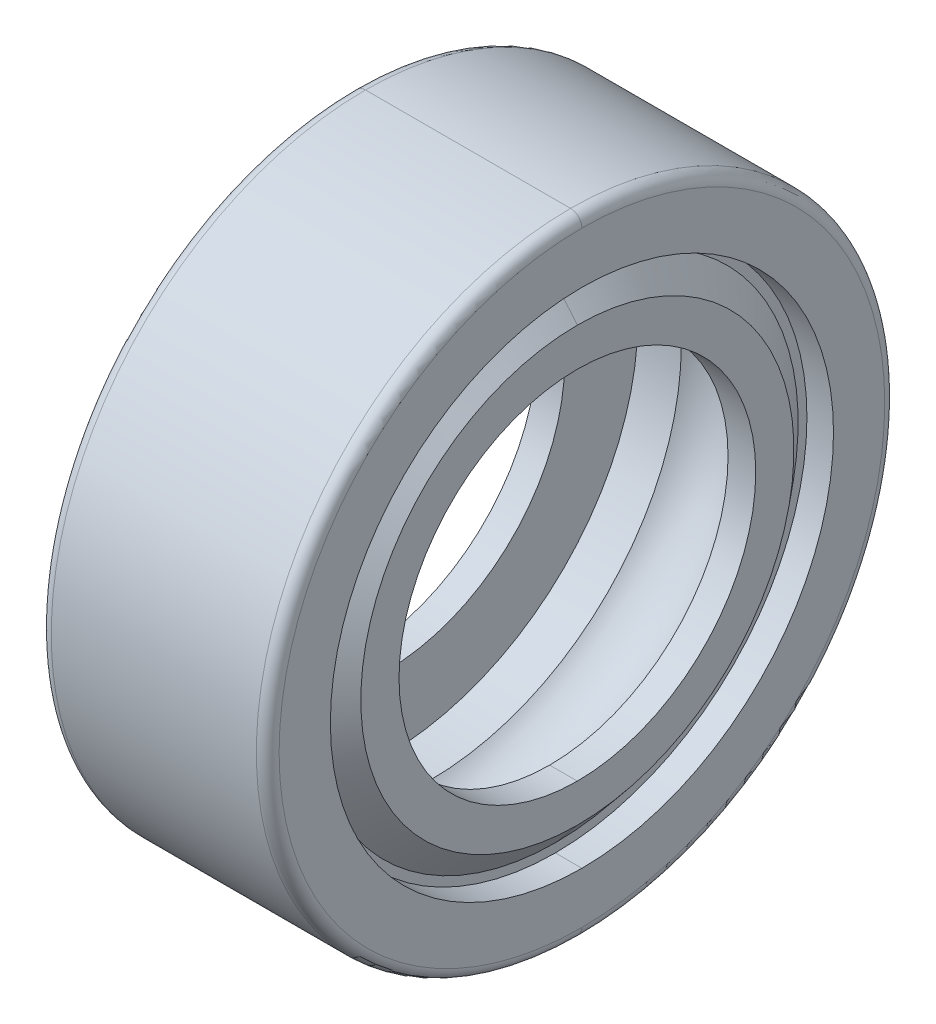
ISO-10303-21;
HEADER;
FILE_DESCRIPTION(('STEP AP214'),'2;1');
FILE_NAME('part.step','',(''),(''),'','','');
FILE_SCHEMA(('AUTOMOTIVE_DESIGN { 1 0 10303 214 1 1 1 1 }'));
ENDSEC;
DATA;
#1=APPLICATION_CONTEXT('core data for automotive mechanical design processes');
#2=APPLICATION_PROTOCOL_DEFINITION('international standard','automotive_design',2000,#1);
#3=PRODUCT_CONTEXT('',#1,'mechanical');
#4=PRODUCT('Part','Part','',(#3));
#5=PRODUCT_RELATED_PRODUCT_CATEGORY('part','',(#4));
#6=PRODUCT_DEFINITION_FORMATION('','',#4);
#7=PRODUCT_DEFINITION_CONTEXT('part definition',#1,'design');
#8=PRODUCT_DEFINITION('design','',#6,#7);
#9=PRODUCT_DEFINITION_SHAPE('','',#8);
#10=(LENGTH_UNIT() NAMED_UNIT(*) SI_UNIT(.MILLI.,.METRE.));
#11=(NAMED_UNIT(*) PLANE_ANGLE_UNIT() SI_UNIT($,.RADIAN.));
#12=(NAMED_UNIT(*) SI_UNIT($,.STERADIAN.) SOLID_ANGLE_UNIT());
#13=UNCERTAINTY_MEASURE_WITH_UNIT(LENGTH_MEASURE(1.E-05),#10,'distance_accuracy_value','');
#14=(GEOMETRIC_REPRESENTATION_CONTEXT(3) GLOBAL_UNCERTAINTY_ASSIGNED_CONTEXT((#13)) GLOBAL_UNIT_ASSIGNED_CONTEXT((#10,
#11,#12)) REPRESENTATION_CONTEXT('',''));
#15=CARTESIAN_POINT('',(0.,0.,0.));
#16=DIRECTION('',(0.,0.,1.));
#17=DIRECTION('',(1.,0.,0.));
#18=AXIS2_PLACEMENT_3D('',#15,#16,#17);
#19=CARTESIAN_POINT('',(-1.52914173633304,0.,0.));
#20=DIRECTION('',(1.,0.,0.));
#21=DIRECTION('',(0.,1.,0.));
#22=AXIS2_PLACEMENT_3D('',#19,#20,#21);
#23=PLANE('',#22);
#24=CARTESIAN_POINT('',(-1.52914173633304,0.,0.));
#25=DIRECTION('',(-1.,0.,0.));
#26=DIRECTION('',(0.,1.,0.));
#27=AXIS2_PLACEMENT_3D('',#24,#25,#26);
#28=CIRCLE('',#27,4.2484058415);
#29=CARTESIAN_POINT('',(-1.52914173633304,4.2484058415,0.));
#30=VERTEX_POINT('',#29);
#31=CARTESIAN_POINT('',(-1.52914173633304,-4.2484058415,0.));
#32=VERTEX_POINT('',#31);
#33=EDGE_CURVE('E270',#30,#32,#28,.T.);
#34=ORIENTED_EDGE('',*,*,#33,.F.);
#35=CARTESIAN_POINT('',(-1.52914173633304,0.,0.));
#36=DIRECTION('',(1.,0.,0.));
#37=DIRECTION('',(0.,1.,0.));
#38=AXIS2_PLACEMENT_3D('',#35,#36,#37);
#39=CIRCLE('',#38,4.2484058415);
#40=EDGE_CURVE('E303',#30,#32,#39,.T.);
#41=ORIENTED_EDGE('',*,*,#40,.T.);
#42=EDGE_LOOP('',(#34,#41));
#43=FACE_BOUND('',#42,.T.);
#44=CARTESIAN_POINT('',(-1.52914173633304,0.,0.));
#45=DIRECTION('',(1.,0.,0.));
#46=DIRECTION('',(0.,-1.,0.));
#47=AXIS2_PLACEMENT_3D('',#44,#45,#46);
#48=CIRCLE('',#47,4.4024931);
#49=CARTESIAN_POINT('',(-1.52914173633304,-4.4024931,0.));
#50=VERTEX_POINT('',#49);
#51=CARTESIAN_POINT('',(-1.52914173633304,4.4024931,0.));
#52=VERTEX_POINT('',#51);
#53=EDGE_CURVE('E28',#50,#52,#48,.T.);
#54=ORIENTED_EDGE('',*,*,#53,.F.);
#55=CARTESIAN_POINT('',(-1.52914173633304,0.,0.));
#56=DIRECTION('',(1.,0.,0.));
#57=DIRECTION('',(0.,1.,0.));
#58=AXIS2_PLACEMENT_3D('',#55,#56,#57);
#59=CIRCLE('',#58,4.4024931);
#60=EDGE_CURVE('E11',#52,#50,#59,.T.);
#61=ORIENTED_EDGE('',*,*,#60,.F.);
#62=EDGE_LOOP('',(#54,#61));
#63=FACE_BOUND('',#62,.T.);
#64=ADVANCED_FACE('F17',(#43,#63),#23,.F.);
#65=CARTESIAN_POINT('',(-2.19329,0.,0.));
#66=DIRECTION('',(1.,0.,0.));
#67=DIRECTION('',(0.,-1.,0.));
#68=AXIS2_PLACEMENT_3D('',#65,#66,#67);
#69=CYLINDRICAL_SURFACE('',#68,4.4024931);
#70=DIRECTION('',(1.,0.,0.));
#71=VECTOR('',#70,1.);
#72=CARTESIAN_POINT('',(-1.9939,-4.4024931,0.));
#73=LINE('',#72,#71);
#74=CARTESIAN_POINT('',(-1.9939,-4.4024931,0.));
#75=VERTEX_POINT('',#74);
#76=EDGE_CURVE('E355',#75,#50,#73,.T.);
#77=ORIENTED_EDGE('',*,*,#76,.F.);
#78=CARTESIAN_POINT('',(-1.9939,0.,0.));
#79=DIRECTION('',(1.,0.,0.));
#80=DIRECTION('',(0.,1.,0.));
#81=AXIS2_PLACEMENT_3D('',#78,#79,#80);
#82=CIRCLE('',#81,4.4024931);
#83=CARTESIAN_POINT('',(-1.9939,4.4024931,0.));
#84=VERTEX_POINT('',#83);
#85=EDGE_CURVE('E191',#84,#75,#82,.T.);
#86=ORIENTED_EDGE('',*,*,#85,.F.);
#87=DIRECTION('',(1.,0.,0.));
#88=VECTOR('',#87,1.);
#89=CARTESIAN_POINT('',(-1.9939,4.4024931,0.));
#90=LINE('',#89,#88);
#91=EDGE_CURVE('E194',#84,#52,#90,.T.);
#92=ORIENTED_EDGE('',*,*,#91,.T.);
#93=ORIENTED_EDGE('',*,*,#60,.T.);
#94=EDGE_LOOP('',(#77,#86,#92,#93));
#95=FACE_BOUND('',#94,.T.);
#96=ADVANCED_FACE('F635',(#95),#69,.F.);
#97=CARTESIAN_POINT('',(-2.19329,0.,0.));
#98=DIRECTION('',(1.,0.,0.));
#99=DIRECTION('',(0.,-1.,0.));
#100=AXIS2_PLACEMENT_3D('',#97,#98,#99);
#101=CYLINDRICAL_SURFACE('',#100,4.4024931);
#102=ORIENTED_EDGE('',*,*,#91,.F.);
#103=CARTESIAN_POINT('',(-1.9939,0.,0.));
#104=DIRECTION('',(-1.,0.,0.));
#105=DIRECTION('',(0.,1.,0.));
#106=AXIS2_PLACEMENT_3D('',#103,#104,#105);
#107=CIRCLE('',#106,4.4024931);
#108=EDGE_CURVE('E163',#84,#75,#107,.T.);
#109=ORIENTED_EDGE('',*,*,#108,.T.);
#110=ORIENTED_EDGE('',*,*,#76,.T.);
#111=ORIENTED_EDGE('',*,*,#53,.T.);
#112=EDGE_LOOP('',(#102,#109,#110,#111));
#113=FACE_BOUND('',#112,.T.);
#114=ADVANCED_FACE('F782',(#113),#101,.F.);
#115=CARTESIAN_POINT('',(-1.9939,0.,0.));
#116=DIRECTION('',(1.,0.,0.));
#117=DIRECTION('',(0.,1.,0.));
#118=AXIS2_PLACEMENT_3D('',#115,#116,#117);
#119=PLANE('',#118);
#120=ORIENTED_EDGE('',*,*,#108,.F.);
#121=ORIENTED_EDGE('',*,*,#85,.T.);
#122=EDGE_LOOP('',(#120,#121));
#123=FACE_BOUND('',#122,.T.);
#124=CARTESIAN_POINT('',(-1.9939,0.,0.));
#125=DIRECTION('',(1.,0.,0.));
#126=DIRECTION('',(0.,1.,0.));
#127=AXIS2_PLACEMENT_3D('',#124,#125,#126);
#128=CIRCLE('',#127,5.29971);
#129=CARTESIAN_POINT('',(-1.9939,5.29971,0.));
#130=VERTEX_POINT('',#129);
#131=CARTESIAN_POINT('',(-1.9939,-5.29971,0.));
#132=VERTEX_POINT('',#131);
#133=EDGE_CURVE('E161',#130,#132,#128,.T.);
#134=ORIENTED_EDGE('',*,*,#133,.F.);
#135=CARTESIAN_POINT('',(-1.9939,0.,0.));
#136=DIRECTION('',(-1.,0.,0.));
#137=DIRECTION('',(0.,1.,0.));
#138=AXIS2_PLACEMENT_3D('',#135,#136,#137);
#139=CIRCLE('',#138,5.29971);
#140=EDGE_CURVE('E152',#130,#132,#139,.T.);
#141=ORIENTED_EDGE('',*,*,#140,.T.);
#142=EDGE_LOOP('',(#134,#141));
#143=FACE_BOUND('',#142,.T.);
#144=ADVANCED_FACE('F159',(#123,#143),#119,.F.);
#145=CARTESIAN_POINT('',(-1.79451,0.,0.));
#146=DIRECTION('',(1.,0.,0.));
#147=DIRECTION('',(0.,-1.,0.));
#148=AXIS2_PLACEMENT_3D('',#145,#146,#147);
#149=TOROIDAL_SURFACE('',#148,5.29971,0.19939);
#150=CARTESIAN_POINT('',(-1.79451,0.,0.));
#151=DIRECTION('',(-1.,0.,0.));
#152=DIRECTION('',(0.,1.,0.));
#153=AXIS2_PLACEMENT_3D('',#150,#151,#152);
#154=CIRCLE('',#153,5.4991);
#155=CARTESIAN_POINT('',(-1.79451,5.4991,0.));
#156=VERTEX_POINT('',#155);
#157=CARTESIAN_POINT('',(-1.79451,-5.4991,0.));
#158=VERTEX_POINT('',#157);
#159=EDGE_CURVE('E170',#156,#158,#154,.T.);
#160=ORIENTED_EDGE('',*,*,#159,.T.);
#161=CARTESIAN_POINT('',(-1.79451,-5.29971,0.));
#162=DIRECTION('',(0.,0.,-1.));
#163=DIRECTION('',(0.,-1.,0.));
#164=AXIS2_PLACEMENT_3D('',#161,#162,#163);
#165=CIRCLE('',#164,0.19939);
#166=EDGE_CURVE('E167',#158,#132,#165,.T.);
#167=ORIENTED_EDGE('',*,*,#166,.T.);
#168=ORIENTED_EDGE('',*,*,#140,.F.);
#169=CARTESIAN_POINT('',(-1.79451,5.29971,0.));
#170=DIRECTION('',(0.,0.,1.));
#171=DIRECTION('',(0.,1.,0.));
#172=AXIS2_PLACEMENT_3D('',#169,#170,#171);
#173=CIRCLE('',#172,0.19939);
#174=EDGE_CURVE('E164',#156,#130,#173,.T.);
#175=ORIENTED_EDGE('',*,*,#174,.F.);
#176=EDGE_LOOP('',(#160,#167,#168,#175));
#177=FACE_BOUND('',#176,.T.);
#178=ADVANCED_FACE('F168',(#177),#149,.T.);
#179=CARTESIAN_POINT('',(-1.79451,0.,0.));
#180=DIRECTION('',(1.,0.,0.));
#181=DIRECTION('',(0.,-1.,0.));
#182=AXIS2_PLACEMENT_3D('',#179,#180,#181);
#183=TOROIDAL_SURFACE('',#182,5.29971,0.19939);
#184=ORIENTED_EDGE('',*,*,#133,.T.);
#185=ORIENTED_EDGE('',*,*,#166,.F.);
#186=CARTESIAN_POINT('',(-1.79451,0.,0.));
#187=DIRECTION('',(1.,0.,0.));
#188=DIRECTION('',(0.,1.,0.));
#189=AXIS2_PLACEMENT_3D('',#186,#187,#188);
#190=CIRCLE('',#189,5.4991);
#191=EDGE_CURVE('E179',#156,#158,#190,.T.);
#192=ORIENTED_EDGE('',*,*,#191,.F.);
#193=ORIENTED_EDGE('',*,*,#174,.T.);
#194=EDGE_LOOP('',(#184,#185,#192,#193));
#195=FACE_BOUND('',#194,.T.);
#196=ADVANCED_FACE('F177',(#195),#183,.T.);
#197=CARTESIAN_POINT('',(-2.19329,0.,0.));
#198=DIRECTION('',(1.,0.,0.));
#199=DIRECTION('',(0.,-1.,0.));
#200=AXIS2_PLACEMENT_3D('',#197,#198,#199);
#201=CYLINDRICAL_SURFACE('',#200,5.4991);
#202=ORIENTED_EDGE('',*,*,#191,.T.);
#203=DIRECTION('',(-1.,0.,0.));
#204=VECTOR('',#203,1.);
#205=CARTESIAN_POINT('',(1.79451,-5.4991,0.));
#206=LINE('',#205,#204);
#207=CARTESIAN_POINT('',(1.79451,-5.4991,0.));
#208=VERTEX_POINT('',#207);
#209=EDGE_CURVE('E236',#208,#158,#206,.T.);
#210=ORIENTED_EDGE('',*,*,#209,.F.);
#211=CARTESIAN_POINT('',(1.79451,0.,0.));
#212=DIRECTION('',(1.,0.,0.));
#213=DIRECTION('',(0.,1.,0.));
#214=AXIS2_PLACEMENT_3D('',#211,#212,#213);
#215=CIRCLE('',#214,5.4991);
#216=CARTESIAN_POINT('',(1.79451,5.4991,0.));
#217=VERTEX_POINT('',#216);
#218=EDGE_CURVE('E264',#217,#208,#215,.T.);
#219=ORIENTED_EDGE('',*,*,#218,.F.);
#220=DIRECTION('',(-1.,0.,0.));
#221=VECTOR('',#220,1.);
#222=CARTESIAN_POINT('',(1.79451,5.4991,0.));
#223=LINE('',#222,#221);
#224=EDGE_CURVE('E185',#217,#156,#223,.T.);
#225=ORIENTED_EDGE('',*,*,#224,.T.);
#226=EDGE_LOOP('',(#202,#210,#219,#225));
#227=FACE_BOUND('',#226,.T.);
#228=ADVANCED_FACE('F930',(#227),#201,.T.);
#229=CARTESIAN_POINT('',(-2.19329,0.,0.));
#230=DIRECTION('',(1.,0.,0.));
#231=DIRECTION('',(0.,-1.,0.));
#232=AXIS2_PLACEMENT_3D('',#229,#230,#231);
#233=CYLINDRICAL_SURFACE('',#232,5.4991);
#234=CARTESIAN_POINT('',(1.79451,0.,0.));
#235=DIRECTION('',(-1.,0.,0.));
#236=DIRECTION('',(0.,1.,0.));
#237=AXIS2_PLACEMENT_3D('',#234,#235,#236);
#238=CIRCLE('',#237,5.4991);
#239=EDGE_CURVE('E239',#217,#208,#238,.T.);
#240=ORIENTED_EDGE('',*,*,#239,.T.);
#241=ORIENTED_EDGE('',*,*,#209,.T.);
#242=ORIENTED_EDGE('',*,*,#159,.F.);
#243=ORIENTED_EDGE('',*,*,#224,.F.);
#244=EDGE_LOOP('',(#240,#241,#242,#243));
#245=FACE_BOUND('',#244,.T.);
#246=ADVANCED_FACE('F841',(#245),#233,.T.);
#247=CARTESIAN_POINT('',(1.79451,0.,0.));
#248=DIRECTION('',(1.,0.,0.));
#249=DIRECTION('',(0.,-1.,0.));
#250=AXIS2_PLACEMENT_3D('',#247,#248,#249);
#251=TOROIDAL_SURFACE('',#250,5.29971,0.19939);
#252=CARTESIAN_POINT('',(1.9939,0.,0.));
#253=DIRECTION('',(-1.,0.,0.));
#254=DIRECTION('',(0.,1.,0.));
#255=AXIS2_PLACEMENT_3D('',#252,#253,#254);
#256=CIRCLE('',#255,5.29971);
#257=CARTESIAN_POINT('',(1.9939,5.29971,0.));
#258=VERTEX_POINT('',#257);
#259=CARTESIAN_POINT('',(1.9939,-5.29971,0.));
#260=VERTEX_POINT('',#259);
#261=EDGE_CURVE('E262',#258,#260,#256,.T.);
#262=ORIENTED_EDGE('',*,*,#261,.T.);
#263=CARTESIAN_POINT('',(1.79451,-5.29971,0.));
#264=DIRECTION('',(0.,0.,-1.));
#265=DIRECTION('',(1.,0.,0.));
#266=AXIS2_PLACEMENT_3D('',#263,#264,#265);
#267=CIRCLE('',#266,0.19939);
#268=EDGE_CURVE('E268',#260,#208,#267,.T.);
#269=ORIENTED_EDGE('',*,*,#268,.T.);
#270=ORIENTED_EDGE('',*,*,#239,.F.);
#271=CARTESIAN_POINT('',(1.79451,5.29971,0.));
#272=DIRECTION('',(0.,0.,1.));
#273=DIRECTION('',(1.,0.,0.));
#274=AXIS2_PLACEMENT_3D('',#271,#272,#273);
#275=CIRCLE('',#274,0.19939);
#276=EDGE_CURVE('E189',#258,#217,#275,.T.);
#277=ORIENTED_EDGE('',*,*,#276,.F.);
#278=EDGE_LOOP('',(#262,#269,#270,#277));
#279=FACE_BOUND('',#278,.T.);
#280=ADVANCED_FACE('F770',(#279),#251,.T.);
#281=CARTESIAN_POINT('',(1.79451,0.,0.));
#282=DIRECTION('',(1.,0.,0.));
#283=DIRECTION('',(0.,-1.,0.));
#284=AXIS2_PLACEMENT_3D('',#281,#282,#283);
#285=TOROIDAL_SURFACE('',#284,5.29971,0.19939);
#286=ORIENTED_EDGE('',*,*,#218,.T.);
#287=ORIENTED_EDGE('',*,*,#268,.F.);
#288=CARTESIAN_POINT('',(1.9939,0.,0.));
#289=DIRECTION('',(1.,0.,0.));
#290=DIRECTION('',(0.,1.,0.));
#291=AXIS2_PLACEMENT_3D('',#288,#289,#290);
#292=CIRCLE('',#291,5.29971);
#293=EDGE_CURVE('E269',#258,#260,#292,.T.);
#294=ORIENTED_EDGE('',*,*,#293,.F.);
#295=ORIENTED_EDGE('',*,*,#276,.T.);
#296=EDGE_LOOP('',(#286,#287,#294,#295));
#297=FACE_BOUND('',#296,.T.);
#298=ADVANCED_FACE('F764',(#297),#285,.T.);
#299=CARTESIAN_POINT('',(1.9939,0.,0.));
#300=DIRECTION('',(1.,0.,0.));
#301=DIRECTION('',(0.,1.,0.));
#302=AXIS2_PLACEMENT_3D('',#299,#300,#301);
#303=PLANE('',#302);
#304=CARTESIAN_POINT('',(1.9939,0.,0.));
#305=DIRECTION('',(1.,0.,0.));
#306=DIRECTION('',(0.,1.,0.));
#307=AXIS2_PLACEMENT_3D('',#304,#305,#306);
#308=CIRCLE('',#307,4.4024931);
#309=CARTESIAN_POINT('',(1.9939,4.4024931,0.));
#310=VERTEX_POINT('',#309);
#311=CARTESIAN_POINT('',(1.9939,-4.4024931,0.));
#312=VERTEX_POINT('',#311);
#313=EDGE_CURVE('E200',#310,#312,#308,.T.);
#314=ORIENTED_EDGE('',*,*,#313,.F.);
#315=CARTESIAN_POINT('',(1.9939,0.,0.));
#316=DIRECTION('',(-1.,0.,0.));
#317=DIRECTION('',(0.,1.,0.));
#318=AXIS2_PLACEMENT_3D('',#315,#316,#317);
#319=CIRCLE('',#318,4.4024931);
#320=EDGE_CURVE('E258',#310,#312,#319,.T.);
#321=ORIENTED_EDGE('',*,*,#320,.T.);
#322=EDGE_LOOP('',(#314,#321));
#323=FACE_BOUND('',#322,.T.);
#324=ORIENTED_EDGE('',*,*,#261,.F.);
#325=ORIENTED_EDGE('',*,*,#293,.T.);
#326=EDGE_LOOP('',(#324,#325));
#327=FACE_BOUND('',#326,.T.);
#328=ADVANCED_FACE('F769',(#323,#327),#303,.T.);
#329=CARTESIAN_POINT('',(-2.19329,0.,0.));
#330=DIRECTION('',(1.,0.,0.));
#331=DIRECTION('',(0.,-1.,0.));
#332=AXIS2_PLACEMENT_3D('',#329,#330,#331);
#333=CYLINDRICAL_SURFACE('',#332,4.4024931);
#334=DIRECTION('',(1.,0.,0.));
#335=VECTOR('',#334,1.);
#336=CARTESIAN_POINT('',(1.52914173633304,-4.4024931,0.));
#337=LINE('',#336,#335);
#338=CARTESIAN_POINT('',(1.52914173633304,-4.4024931,0.));
#339=VERTEX_POINT('',#338);
#340=EDGE_CURVE('E307',#339,#312,#337,.T.);
#341=ORIENTED_EDGE('',*,*,#340,.T.);
#342=ORIENTED_EDGE('',*,*,#320,.F.);
#343=DIRECTION('',(1.,0.,0.));
#344=VECTOR('',#343,1.);
#345=CARTESIAN_POINT('',(1.52914173633304,4.4024931,0.));
#346=LINE('',#345,#344);
#347=CARTESIAN_POINT('',(1.52914173633304,4.4024931,0.));
#348=VERTEX_POINT('',#347);
#349=EDGE_CURVE('E196',#348,#310,#346,.T.);
#350=ORIENTED_EDGE('',*,*,#349,.F.);
#351=CARTESIAN_POINT('',(1.52914173633304,0.,0.));
#352=DIRECTION('',(1.,0.,0.));
#353=DIRECTION('',(0.,-1.,0.));
#354=AXIS2_PLACEMENT_3D('',#351,#352,#353);
#355=CIRCLE('',#354,4.4024931);
#356=EDGE_CURVE('E263',#339,#348,#355,.T.);
#357=ORIENTED_EDGE('',*,*,#356,.F.);
#358=EDGE_LOOP('',(#341,#342,#350,#357));
#359=FACE_BOUND('',#358,.T.);
#360=ADVANCED_FACE('F651',(#359),#333,.F.);
#361=CARTESIAN_POINT('',(1.52914173633304,0.,0.));
#362=DIRECTION('',(1.,0.,0.));
#363=DIRECTION('',(0.,1.,0.));
#364=AXIS2_PLACEMENT_3D('',#361,#362,#363);
#365=PLANE('',#364);
#366=CARTESIAN_POINT('',(1.52914173633304,0.,0.));
#367=DIRECTION('',(1.,0.,0.));
#368=DIRECTION('',(0.,1.,0.));
#369=AXIS2_PLACEMENT_3D('',#366,#367,#368);
#370=CIRCLE('',#369,4.2484058415);
#371=CARTESIAN_POINT('',(1.52914173633304,4.2484058415,0.));
#372=VERTEX_POINT('',#371);
#373=CARTESIAN_POINT('',(1.52914173633304,-4.2484058415,0.));
#374=VERTEX_POINT('',#373);
#375=EDGE_CURVE('E218',#372,#374,#370,.T.);
#376=ORIENTED_EDGE('',*,*,#375,.F.);
#377=CARTESIAN_POINT('',(1.52914173633304,0.,0.));
#378=DIRECTION('',(-1.,0.,0.));
#379=DIRECTION('',(0.,1.,0.));
#380=AXIS2_PLACEMENT_3D('',#377,#378,#379);
#381=CIRCLE('',#380,4.2484058415);
#382=EDGE_CURVE('E201',#372,#374,#381,.T.);
#383=ORIENTED_EDGE('',*,*,#382,.T.);
#384=EDGE_LOOP('',(#376,#383));
#385=FACE_BOUND('',#384,.T.);
#386=ORIENTED_EDGE('',*,*,#356,.T.);
#387=CARTESIAN_POINT('',(1.52914173633304,0.,0.));
#388=DIRECTION('',(1.,0.,0.));
#389=DIRECTION('',(0.,1.,0.));
#390=AXIS2_PLACEMENT_3D('',#387,#388,#389);
#391=CIRCLE('',#390,4.4024931);
#392=EDGE_CURVE('E293',#348,#339,#391,.T.);
#393=ORIENTED_EDGE('',*,*,#392,.T.);
#394=EDGE_LOOP('',(#386,#393));
#395=FACE_BOUND('',#394,.T.);
#396=ADVANCED_FACE('F410',(#385,#395),#365,.T.);
#397=CARTESIAN_POINT('',(-2.19329,0.,0.));
#398=DIRECTION('',(1.,0.,0.));
#399=DIRECTION('',(0.,-1.,0.));
#400=AXIS2_PLACEMENT_3D('',#397,#398,#399);
#401=CYLINDRICAL_SURFACE('',#400,4.4024931);
#402=ORIENTED_EDGE('',*,*,#349,.T.);
#403=ORIENTED_EDGE('',*,*,#313,.T.);
#404=ORIENTED_EDGE('',*,*,#340,.F.);
#405=ORIENTED_EDGE('',*,*,#392,.F.);
#406=EDGE_LOOP('',(#402,#403,#404,#405));
#407=FACE_BOUND('',#406,.T.);
#408=ADVANCED_FACE('F650',(#407),#401,.F.);
#409=CARTESIAN_POINT('',(1.92652939525596,0.,0.));
#410=DIRECTION('',(-1.,0.,0.));
#411=DIRECTION('',(0.,1.,0.));
#412=AXIS2_PLACEMENT_3D('',#409,#410,#411);
#413=CONICAL_SURFACE('',#412,3.77481767132601,0.872664625997164);
#414=CARTESIAN_POINT('',(1.914144,0.,0.));
#415=DIRECTION('',(-1.,0.,0.));
#416=DIRECTION('',(0.,1.,0.));
#417=AXIS2_PLACEMENT_3D('',#414,#415,#416);
#418=CIRCLE('',#417,3.789578010618);
#419=CARTESIAN_POINT('',(1.914144,3.789578010618,0.));
#420=VERTEX_POINT('',#419);
#421=CARTESIAN_POINT('',(1.914144,-3.789578010618,0.));
#422=VERTEX_POINT('',#421);
#423=EDGE_CURVE('E219',#420,#422,#418,.T.);
#424=ORIENTED_EDGE('',*,*,#423,.T.);
#425=DIRECTION('',(-0.642787609686539,-0.766044443118978,0.));
#426=VECTOR('',#425,1.);
#427=CARTESIAN_POINT('',(1.914144,-3.789578010618,0.));
#428=LINE('',#427,#426);
#429=EDGE_CURVE('E252',#422,#374,#428,.T.);
#430=ORIENTED_EDGE('',*,*,#429,.T.);
#431=ORIENTED_EDGE('',*,*,#382,.F.);
#432=DIRECTION('',(-0.642787609686539,0.766044443118978,0.));
#433=VECTOR('',#432,1.);
#434=CARTESIAN_POINT('',(1.914144,3.789578010618,0.));
#435=LINE('',#434,#433);
#436=EDGE_CURVE('E242',#420,#372,#435,.T.);
#437=ORIENTED_EDGE('',*,*,#436,.F.);
#438=EDGE_LOOP('',(#424,#430,#431,#437));
#439=FACE_BOUND('',#438,.T.);
#440=ADVANCED_FACE('F19',(#439),#413,.T.);
#441=CARTESIAN_POINT('',(1.92652939525596,0.,0.));
#442=DIRECTION('',(-1.,0.,0.));
#443=DIRECTION('',(0.,1.,0.));
#444=AXIS2_PLACEMENT_3D('',#441,#442,#443);
#445=CONICAL_SURFACE('',#444,3.77481767132601,0.872664625997164);
#446=ORIENTED_EDGE('',*,*,#375,.T.);
#447=ORIENTED_EDGE('',*,*,#429,.F.);
#448=CARTESIAN_POINT('',(1.914144,0.,0.));
#449=DIRECTION('',(1.,0.,0.));
#450=DIRECTION('',(0.,1.,0.));
#451=AXIS2_PLACEMENT_3D('',#448,#449,#450);
#452=CIRCLE('',#451,3.789578010618);
#453=EDGE_CURVE('E214',#420,#422,#452,.T.);
#454=ORIENTED_EDGE('',*,*,#453,.F.);
#455=ORIENTED_EDGE('',*,*,#436,.T.);
#456=EDGE_LOOP('',(#446,#447,#454,#455));
#457=FACE_BOUND('',#456,.T.);
#458=ADVANCED_FACE('F408',(#457),#445,.T.);
#459=CARTESIAN_POINT('',(1.914144,0.,0.));
#460=DIRECTION('',(1.,0.,0.));
#461=DIRECTION('',(0.,1.,0.));
#462=AXIS2_PLACEMENT_3D('',#459,#460,#461);
#463=PLANE('',#462);
#464=CARTESIAN_POINT('',(1.914144,0.,0.));
#465=DIRECTION('',(1.,0.,0.));
#466=DIRECTION('',(0.,1.,0.));
#467=AXIS2_PLACEMENT_3D('',#464,#465,#466);
#468=CIRCLE('',#467,3.121411969);
#469=CARTESIAN_POINT('',(1.914144,3.121411969,0.));
#470=VERTEX_POINT('',#469);
#471=CARTESIAN_POINT('',(1.914144,-3.121411969,0.));
#472=VERTEX_POINT('',#471);
#473=EDGE_CURVE('E281',#470,#472,#468,.T.);
#474=ORIENTED_EDGE('',*,*,#473,.F.);
#475=CARTESIAN_POINT('',(1.914144,0.,0.));
#476=DIRECTION('',(-1.,0.,0.));
#477=DIRECTION('',(0.,1.,0.));
#478=AXIS2_PLACEMENT_3D('',#475,#476,#477);
#479=CIRCLE('',#478,3.121411969);
#480=EDGE_CURVE('E320',#470,#472,#479,.T.);
#481=ORIENTED_EDGE('',*,*,#480,.T.);
#482=EDGE_LOOP('',(#474,#481));
#483=FACE_BOUND('',#482,.T.);
#484=ORIENTED_EDGE('',*,*,#423,.F.);
#485=ORIENTED_EDGE('',*,*,#453,.T.);
#486=EDGE_LOOP('',(#484,#485));
#487=FACE_BOUND('',#486,.T.);
#488=ADVANCED_FACE('F426',(#483,#487),#463,.T.);
#489=CARTESIAN_POINT('',(-2.1055584,0.,0.));
#490=DIRECTION('',(1.,0.,0.));
#491=DIRECTION('',(0.,-1.,0.));
#492=AXIS2_PLACEMENT_3D('',#489,#490,#491);
#493=CYLINDRICAL_SURFACE('',#492,3.121411969);
#494=CARTESIAN_POINT('',(1.42944673633304,0.,0.));
#495=DIRECTION('',(-1.,0.,0.));
#496=DIRECTION('',(0.,1.,0.));
#497=AXIS2_PLACEMENT_3D('',#494,#495,#496);
#498=CIRCLE('',#497,3.121411969);
#499=CARTESIAN_POINT('',(1.42944673633304,3.121411969,0.));
#500=VERTEX_POINT('',#499);
#501=CARTESIAN_POINT('',(1.42944673633304,-3.121411969,0.));
#502=VERTEX_POINT('',#501);
#503=EDGE_CURVE('E308',#500,#502,#498,.T.);
#504=ORIENTED_EDGE('',*,*,#503,.T.);
#505=DIRECTION('',(1.,0.,0.));
#506=VECTOR('',#505,1.);
#507=CARTESIAN_POINT('',(1.42944673633304,-3.121411969,0.));
#508=LINE('',#507,#506);
#509=EDGE_CURVE('E276',#502,#472,#508,.T.);
#510=ORIENTED_EDGE('',*,*,#509,.T.);
#511=ORIENTED_EDGE('',*,*,#480,.F.);
#512=DIRECTION('',(1.,0.,0.));
#513=VECTOR('',#512,1.);
#514=CARTESIAN_POINT('',(1.42944673633304,3.121411969,0.));
#515=LINE('',#514,#513);
#516=EDGE_CURVE('E280',#500,#470,#515,.T.);
#517=ORIENTED_EDGE('',*,*,#516,.F.);
#518=EDGE_LOOP('',(#504,#510,#511,#517));
#519=FACE_BOUND('',#518,.T.);
#520=ADVANCED_FACE('F429',(#519),#493,.F.);
#521=CARTESIAN_POINT('',(-2.1055584,0.,0.));
#522=DIRECTION('',(1.,0.,0.));
#523=DIRECTION('',(0.,-1.,0.));
#524=AXIS2_PLACEMENT_3D('',#521,#522,#523);
#525=CYLINDRICAL_SURFACE('',#524,3.121411969);
#526=ORIENTED_EDGE('',*,*,#473,.T.);
#527=ORIENTED_EDGE('',*,*,#509,.F.);
#528=CARTESIAN_POINT('',(1.42944673633304,0.,0.));
#529=DIRECTION('',(1.,0.,0.));
#530=DIRECTION('',(0.,1.,0.));
#531=AXIS2_PLACEMENT_3D('',#528,#529,#530);
#532=CIRCLE('',#531,3.121411969);
#533=EDGE_CURVE('E21',#500,#502,#532,.T.);
#534=ORIENTED_EDGE('',*,*,#533,.F.);
#535=ORIENTED_EDGE('',*,*,#516,.T.);
#536=EDGE_LOOP('',(#526,#527,#534,#535));
#537=FACE_BOUND('',#536,.T.);
#538=ADVANCED_FACE('F434',(#537),#525,.F.);
#539=CARTESIAN_POINT('',(1.42944673633304,0.,0.));
#540=DIRECTION('',(1.,0.,0.));
#541=DIRECTION('',(0.,1.,0.));
#542=AXIS2_PLACEMENT_3D('',#539,#540,#541);
#543=PLANE('',#542);
#544=ORIENTED_EDGE('',*,*,#503,.F.);
#545=ORIENTED_EDGE('',*,*,#533,.T.);
#546=EDGE_LOOP('',(#544,#545));
#547=FACE_BOUND('',#546,.T.);
#548=CARTESIAN_POINT('',(1.42944673633304,0.,0.));
#549=DIRECTION('',(1.,0.,0.));
#550=DIRECTION('',(0.,-1.,0.));
#551=AXIS2_PLACEMENT_3D('',#548,#549,#550);
#552=CIRCLE('',#551,4.4024931);
#553=CARTESIAN_POINT('',(1.42944673633304,-4.4024931,0.));
#554=VERTEX_POINT('',#553);
#555=CARTESIAN_POINT('',(1.42944673633304,4.4024931,0.));
#556=VERTEX_POINT('',#555);
#557=EDGE_CURVE('E212',#554,#556,#552,.T.);
#558=ORIENTED_EDGE('',*,*,#557,.F.);
#559=CARTESIAN_POINT('',(1.42944673633304,0.,0.));
#560=DIRECTION('',(1.,0.,0.));
#561=DIRECTION('',(0.,1.,0.));
#562=AXIS2_PLACEMENT_3D('',#559,#560,#561);
#563=CIRCLE('',#562,4.4024931);
#564=EDGE_CURVE('E223',#556,#554,#563,.T.);
#565=ORIENTED_EDGE('',*,*,#564,.F.);
#566=EDGE_LOOP('',(#558,#565));
#567=FACE_BOUND('',#566,.T.);
#568=ADVANCED_FACE('F437',(#547,#567),#543,.F.);
#569=CARTESIAN_POINT('',(-2.19329,0.,0.));
#570=DIRECTION('',(1.,0.,0.));
#571=DIRECTION('',(0.,-1.,0.));
#572=AXIS2_PLACEMENT_3D('',#569,#570,#571);
#573=CYLINDRICAL_SURFACE('',#572,4.4024931);
#574=DIRECTION('',(1.,0.,0.));
#575=VECTOR('',#574,1.);
#576=CARTESIAN_POINT('',(0.669246824752564,-4.4024931,0.));
#577=LINE('',#576,#575);
#578=CARTESIAN_POINT('',(0.669246824752564,-4.4024931,0.));
#579=VERTEX_POINT('',#578);
#580=EDGE_CURVE('E208',#579,#554,#577,.T.);
#581=ORIENTED_EDGE('',*,*,#580,.F.);
#582=CARTESIAN_POINT('',(0.669246824752564,0.,0.));
#583=DIRECTION('',(1.,0.,0.));
#584=DIRECTION('',(0.,1.,0.));
#585=AXIS2_PLACEMENT_3D('',#582,#583,#584);
#586=CIRCLE('',#585,4.4024931);
#587=CARTESIAN_POINT('',(0.669246824752564,4.4024931,0.));
#588=VERTEX_POINT('',#587);
#589=EDGE_CURVE('E234',#588,#579,#586,.T.);
#590=ORIENTED_EDGE('',*,*,#589,.F.);
#591=DIRECTION('',(1.,0.,0.));
#592=VECTOR('',#591,1.);
#593=CARTESIAN_POINT('',(0.669246824752564,4.4024931,0.));
#594=LINE('',#593,#592);
#595=EDGE_CURVE('E213',#588,#556,#594,.T.);
#596=ORIENTED_EDGE('',*,*,#595,.T.);
#597=ORIENTED_EDGE('',*,*,#564,.T.);
#598=EDGE_LOOP('',(#581,#590,#596,#597));
#599=FACE_BOUND('',#598,.T.);
#600=ADVANCED_FACE('F440',(#599),#573,.F.);
#601=CARTESIAN_POINT('',(-2.19329,0.,0.));
#602=DIRECTION('',(1.,0.,0.));
#603=DIRECTION('',(0.,-1.,0.));
#604=AXIS2_PLACEMENT_3D('',#601,#602,#603);
#605=CYLINDRICAL_SURFACE('',#604,4.4024931);
#606=ORIENTED_EDGE('',*,*,#595,.F.);
#607=CARTESIAN_POINT('',(0.669246824752564,0.,0.));
#608=DIRECTION('',(-1.,0.,0.));
#609=DIRECTION('',(0.,1.,0.));
#610=AXIS2_PLACEMENT_3D('',#607,#608,#609);
#611=CIRCLE('',#610,4.4024931);
#612=EDGE_CURVE('E245',#588,#579,#611,.T.);
#613=ORIENTED_EDGE('',*,*,#612,.T.);
#614=ORIENTED_EDGE('',*,*,#580,.T.);
#615=ORIENTED_EDGE('',*,*,#557,.T.);
#616=EDGE_LOOP('',(#606,#613,#614,#615));
#617=FACE_BOUND('',#616,.T.);
#618=ADVANCED_FACE('F446',(#617),#605,.F.);
#619=CARTESIAN_POINT('',(0.,0.,0.));
#620=DIRECTION('',(1.,0.,0.));
#621=DIRECTION('',(0.,-1.,0.));
#622=AXIS2_PLACEMENT_3D('',#619,#620,#621);
#623=TOROIDAL_SURFACE('',#622,3.7465,0.937133);
#624=CARTESIAN_POINT('',(-0.669246824752565,0.,0.));
#625=DIRECTION('',(-1.,0.,0.));
#626=DIRECTION('',(0.,1.,0.));
#627=AXIS2_PLACEMENT_3D('',#624,#625,#626);
#628=CIRCLE('',#627,4.4024931);
#629=CARTESIAN_POINT('',(-0.669246824752564,4.4024931,0.));
#630=VERTEX_POINT('',#629);
#631=CARTESIAN_POINT('',(-0.669246824752564,-4.4024931,0.));
#632=VERTEX_POINT('',#631);
#633=EDGE_CURVE('E206',#630,#632,#628,.T.);
#634=ORIENTED_EDGE('',*,*,#633,.T.);
#635=CARTESIAN_POINT('',(0.,-3.7465,0.));
#636=DIRECTION('',(0.,0.,1.));
#637=DIRECTION('',(-0.714142842854285,-0.7,0.));
#638=AXIS2_PLACEMENT_3D('',#635,#636,#637);
#639=CIRCLE('',#638,0.937133);
#640=EDGE_CURVE('E230',#632,#579,#639,.T.);
#641=ORIENTED_EDGE('',*,*,#640,.T.);
#642=ORIENTED_EDGE('',*,*,#612,.F.);
#643=CARTESIAN_POINT('',(0.,3.7465,0.));
#644=DIRECTION('',(0.,0.,-1.));
#645=DIRECTION('',(-0.714142842854285,0.7,0.));
#646=AXIS2_PLACEMENT_3D('',#643,#644,#645);
#647=CIRCLE('',#646,0.937133);
#648=EDGE_CURVE('E233',#630,#588,#647,.T.);
#649=ORIENTED_EDGE('',*,*,#648,.F.);
#650=EDGE_LOOP('',(#634,#641,#642,#649));
#651=FACE_BOUND('',#650,.T.);
#652=ADVANCED_FACE('F456',(#651),#623,.F.);
#653=CARTESIAN_POINT('',(0.,0.,0.));
#654=DIRECTION('',(1.,0.,0.));
#655=DIRECTION('',(0.,-1.,0.));
#656=AXIS2_PLACEMENT_3D('',#653,#654,#655);
#657=TOROIDAL_SURFACE('',#656,3.7465,0.937133);
#658=ORIENTED_EDGE('',*,*,#589,.T.);
#659=ORIENTED_EDGE('',*,*,#640,.F.);
#660=CARTESIAN_POINT('',(-0.669246824752565,0.,0.));
#661=DIRECTION('',(1.,0.,0.));
#662=DIRECTION('',(0.,1.,0.));
#663=AXIS2_PLACEMENT_3D('',#660,#661,#662);
#664=CIRCLE('',#663,4.4024931);
#665=EDGE_CURVE('E298',#630,#632,#664,.T.);
#666=ORIENTED_EDGE('',*,*,#665,.F.);
#667=ORIENTED_EDGE('',*,*,#648,.T.);
#668=EDGE_LOOP('',(#658,#659,#666,#667));
#669=FACE_BOUND('',#668,.T.);
#670=ADVANCED_FACE('F459',(#669),#657,.F.);
#671=CARTESIAN_POINT('',(-2.19329,0.,0.));
#672=DIRECTION('',(1.,0.,0.));
#673=DIRECTION('',(0.,-1.,0.));
#674=AXIS2_PLACEMENT_3D('',#671,#672,#673);
#675=CYLINDRICAL_SURFACE('',#674,4.4024931);
#676=DIRECTION('',(1.,0.,0.));
#677=VECTOR('',#676,1.);
#678=CARTESIAN_POINT('',(-1.42944673633304,4.4024931,0.));
#679=LINE('',#678,#677);
#680=CARTESIAN_POINT('',(-1.42944673633304,4.4024931,0.));
#681=VERTEX_POINT('',#680);
#682=EDGE_CURVE('E343',#681,#630,#679,.T.);
#683=ORIENTED_EDGE('',*,*,#682,.T.);
#684=ORIENTED_EDGE('',*,*,#665,.T.);
#685=DIRECTION('',(1.,0.,0.));
#686=VECTOR('',#685,1.);
#687=CARTESIAN_POINT('',(-1.42944673633304,-4.4024931,0.));
#688=LINE('',#687,#686);
#689=CARTESIAN_POINT('',(-1.42944673633304,-4.4024931,0.));
#690=VERTEX_POINT('',#689);
#691=EDGE_CURVE('E202',#690,#632,#688,.T.);
#692=ORIENTED_EDGE('',*,*,#691,.F.);
#693=CARTESIAN_POINT('',(-1.42944673633304,0.,0.));
#694=DIRECTION('',(1.,0.,0.));
#695=DIRECTION('',(0.,1.,0.));
#696=AXIS2_PLACEMENT_3D('',#693,#694,#695);
#697=CIRCLE('',#696,4.4024931);
#698=EDGE_CURVE('E294',#681,#690,#697,.T.);
#699=ORIENTED_EDGE('',*,*,#698,.F.);
#700=EDGE_LOOP('',(#683,#684,#692,#699));
#701=FACE_BOUND('',#700,.T.);
#702=ADVANCED_FACE('F467',(#701),#675,.F.);
#703=CARTESIAN_POINT('',(-1.42944673633304,0.,0.));
#704=DIRECTION('',(1.,0.,0.));
#705=DIRECTION('',(0.,1.,0.));
#706=AXIS2_PLACEMENT_3D('',#703,#704,#705);
#707=PLANE('',#706);
#708=CARTESIAN_POINT('',(-1.42944673633304,0.,0.));
#709=DIRECTION('',(1.,0.,0.));
#710=DIRECTION('',(0.,1.,0.));
#711=AXIS2_PLACEMENT_3D('',#708,#709,#710);
#712=CIRCLE('',#711,3.121411969);
#713=CARTESIAN_POINT('',(-1.42944673633304,3.121411969,0.));
#714=VERTEX_POINT('',#713);
#715=CARTESIAN_POINT('',(-1.42944673633304,-3.121411969,0.));
#716=VERTEX_POINT('',#715);
#717=EDGE_CURVE('E286',#714,#716,#712,.T.);
#718=ORIENTED_EDGE('',*,*,#717,.F.);
#719=CARTESIAN_POINT('',(-1.42944673633304,0.,0.));
#720=DIRECTION('',(-1.,0.,0.));
#721=DIRECTION('',(0.,1.,0.));
#722=AXIS2_PLACEMENT_3D('',#719,#720,#721);
#723=CIRCLE('',#722,3.121411969);
#724=EDGE_CURVE('E207',#714,#716,#723,.T.);
#725=ORIENTED_EDGE('',*,*,#724,.T.);
#726=EDGE_LOOP('',(#718,#725));
#727=FACE_BOUND('',#726,.T.);
#728=CARTESIAN_POINT('',(-1.42944673633304,0.,0.));
#729=DIRECTION('',(1.,0.,0.));
#730=DIRECTION('',(0.,-1.,0.));
#731=AXIS2_PLACEMENT_3D('',#728,#729,#730);
#732=CIRCLE('',#731,4.4024931);
#733=EDGE_CURVE('E299',#690,#681,#732,.T.);
#734=ORIENTED_EDGE('',*,*,#733,.T.);
#735=ORIENTED_EDGE('',*,*,#698,.T.);
#736=EDGE_LOOP('',(#734,#735));
#737=FACE_BOUND('',#736,.T.);
#738=ADVANCED_FACE('F503',(#727,#737),#707,.T.);
#739=CARTESIAN_POINT('',(-2.19329,0.,0.));
#740=DIRECTION('',(1.,0.,0.));
#741=DIRECTION('',(0.,-1.,0.));
#742=AXIS2_PLACEMENT_3D('',#739,#740,#741);
#743=CYLINDRICAL_SURFACE('',#742,4.4024931);
#744=ORIENTED_EDGE('',*,*,#691,.T.);
#745=ORIENTED_EDGE('',*,*,#633,.F.);
#746=ORIENTED_EDGE('',*,*,#682,.F.);
#747=ORIENTED_EDGE('',*,*,#733,.F.);
#748=EDGE_LOOP('',(#744,#745,#746,#747));
#749=FACE_BOUND('',#748,.T.);
#750=ADVANCED_FACE('F470',(#749),#743,.F.);
#751=CARTESIAN_POINT('',(-2.1055584,0.,0.));
#752=DIRECTION('',(1.,0.,0.));
#753=DIRECTION('',(0.,-1.,0.));
#754=AXIS2_PLACEMENT_3D('',#751,#752,#753);
#755=CYLINDRICAL_SURFACE('',#754,3.121411969);
#756=CARTESIAN_POINT('',(-1.914144,0.,0.));
#757=DIRECTION('',(-1.,0.,0.));
#758=DIRECTION('',(0.,1.,0.));
#759=AXIS2_PLACEMENT_3D('',#756,#757,#758);
#760=CIRCLE('',#759,3.121411969);
#761=CARTESIAN_POINT('',(-1.914144,3.121411969,0.));
#762=VERTEX_POINT('',#761);
#763=CARTESIAN_POINT('',(-1.914144,-3.121411969,0.));
#764=VERTEX_POINT('',#763);
#765=EDGE_CURVE('E289',#762,#764,#760,.T.);
#766=ORIENTED_EDGE('',*,*,#765,.T.);
#767=DIRECTION('',(1.,0.,0.));
#768=VECTOR('',#767,1.);
#769=CARTESIAN_POINT('',(-1.914144,-3.121411969,0.));
#770=LINE('',#769,#768);
#771=EDGE_CURVE('E282',#764,#716,#770,.T.);
#772=ORIENTED_EDGE('',*,*,#771,.T.);
#773=ORIENTED_EDGE('',*,*,#724,.F.);
#774=DIRECTION('',(1.,0.,0.));
#775=VECTOR('',#774,1.);
#776=CARTESIAN_POINT('',(-1.914144,3.121411969,0.));
#777=LINE('',#776,#775);
#778=EDGE_CURVE('E229',#762,#714,#777,.T.);
#779=ORIENTED_EDGE('',*,*,#778,.F.);
#780=EDGE_LOOP('',(#766,#772,#773,#779));
#781=FACE_BOUND('',#780,.T.);
#782=ADVANCED_FACE('F501',(#781),#755,.F.);
#783=CARTESIAN_POINT('',(-2.1055584,0.,0.));
#784=DIRECTION('',(1.,0.,0.));
#785=DIRECTION('',(0.,-1.,0.));
#786=AXIS2_PLACEMENT_3D('',#783,#784,#785);
#787=CYLINDRICAL_SURFACE('',#786,3.121411969);
#788=ORIENTED_EDGE('',*,*,#717,.T.);
#789=ORIENTED_EDGE('',*,*,#771,.F.);
#790=CARTESIAN_POINT('',(-1.914144,0.,0.));
#791=DIRECTION('',(1.,0.,0.));
#792=DIRECTION('',(0.,1.,0.));
#793=AXIS2_PLACEMENT_3D('',#790,#791,#792);
#794=CIRCLE('',#793,3.121411969);
#795=EDGE_CURVE('E324',#762,#764,#794,.T.);
#796=ORIENTED_EDGE('',*,*,#795,.F.);
#797=ORIENTED_EDGE('',*,*,#778,.T.);
#798=EDGE_LOOP('',(#788,#789,#796,#797));
#799=FACE_BOUND('',#798,.T.);
#800=ADVANCED_FACE('F494',(#799),#787,.F.);
#801=CARTESIAN_POINT('',(-1.914144,0.,0.));
#802=DIRECTION('',(1.,0.,0.));
#803=DIRECTION('',(0.,1.,0.));
#804=AXIS2_PLACEMENT_3D('',#801,#802,#803);
#805=PLANE('',#804);
#806=ORIENTED_EDGE('',*,*,#765,.F.);
#807=ORIENTED_EDGE('',*,*,#795,.T.);
#808=EDGE_LOOP('',(#806,#807));
#809=FACE_BOUND('',#808,.T.);
#810=CARTESIAN_POINT('',(-1.914144,0.,0.));
#811=DIRECTION('',(1.,0.,0.));
#812=DIRECTION('',(0.,1.,0.));
#813=AXIS2_PLACEMENT_3D('',#810,#811,#812);
#814=CIRCLE('',#813,3.789578010618);
#815=CARTESIAN_POINT('',(-1.914144,3.789578010618,0.));
#816=VERTEX_POINT('',#815);
#817=CARTESIAN_POINT('',(-1.914144,-3.789578010618,0.));
#818=VERTEX_POINT('',#817);
#819=EDGE_CURVE('E253',#816,#818,#814,.T.);
#820=ORIENTED_EDGE('',*,*,#819,.F.);
#821=CARTESIAN_POINT('',(-1.914144,0.,0.));
#822=DIRECTION('',(-1.,0.,0.));
#823=DIRECTION('',(0.,1.,0.));
#824=AXIS2_PLACEMENT_3D('',#821,#822,#823);
#825=CIRCLE('',#824,3.789578010618);
#826=EDGE_CURVE('E274',#816,#818,#825,.T.);
#827=ORIENTED_EDGE('',*,*,#826,.T.);
#828=EDGE_LOOP('',(#820,#827));
#829=FACE_BOUND('',#828,.T.);
#830=ADVANCED_FACE('F499',(#809,#829),#805,.F.);
#831=CARTESIAN_POINT('',(-1.92652939525596,0.,0.));
#832=DIRECTION('',(1.,0.,0.));
#833=DIRECTION('',(0.,-1.,0.));
#834=AXIS2_PLACEMENT_3D('',#831,#832,#833);
#835=CONICAL_SURFACE('',#834,3.77481767132602,0.872664625997164);
#836=ORIENTED_EDGE('',*,*,#33,.T.);
#837=DIRECTION('',(-0.64278760968654,0.766044443118978,0.));
#838=VECTOR('',#837,1.);
#839=CARTESIAN_POINT('',(-1.52914173633304,-4.2484058415,0.));
#840=LINE('',#839,#838);
#841=EDGE_CURVE('E257',#32,#818,#840,.T.);
#842=ORIENTED_EDGE('',*,*,#841,.T.);
#843=ORIENTED_EDGE('',*,*,#826,.F.);
#844=DIRECTION('',(-0.64278760968654,-0.766044443118978,0.));
#845=VECTOR('',#844,1.);
#846=CARTESIAN_POINT('',(-1.52914173633304,4.2484058415,0.));
#847=LINE('',#846,#845);
#848=EDGE_CURVE('E275',#30,#816,#847,.T.);
#849=ORIENTED_EDGE('',*,*,#848,.F.);
#850=EDGE_LOOP('',(#836,#842,#843,#849));
#851=FACE_BOUND('',#850,.T.);
#852=ADVANCED_FACE('F692',(#851),#835,.T.);
#853=CARTESIAN_POINT('',(-1.92652939525596,0.,0.));
#854=DIRECTION('',(1.,0.,0.));
#855=DIRECTION('',(0.,-1.,0.));
#856=AXIS2_PLACEMENT_3D('',#853,#854,#855);
#857=CONICAL_SURFACE('',#856,3.77481767132602,0.872664625997164);
#858=ORIENTED_EDGE('',*,*,#819,.T.);
#859=ORIENTED_EDGE('',*,*,#841,.F.);
#860=ORIENTED_EDGE('',*,*,#40,.F.);
#861=ORIENTED_EDGE('',*,*,#848,.T.);
#862=EDGE_LOOP('',(#858,#859,#860,#861));
#863=FACE_BOUND('',#862,.T.);
#864=ADVANCED_FACE('F704',(#863),#857,.T.);
#865=CLOSED_SHELL('',(#64,#96,#114,#144,#178,#196,#228,#246,#280,#298,#328,#360,#396,#408,#440,
#458,#488,#520,#538,#568,#600,#618,#652,#670,#702,#738,#750,#782,#800,#830,#852,#864));
#866=MANIFOLD_SOLID_BREP('B1',#865);
#867=ADVANCED_BREP_SHAPE_REPRESENTATION('',(#18,#866),#14);
#868=SHAPE_DEFINITION_REPRESENTATION(#9,#867);
ENDSEC;
END-ISO-10303-21;
